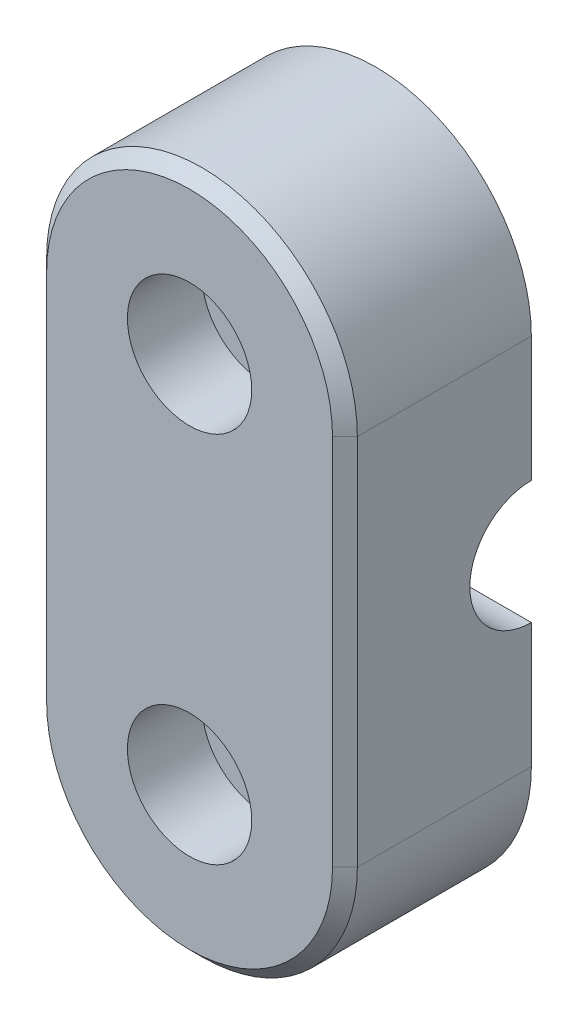
ISO-10303-21;
HEADER;
FILE_DESCRIPTION(('STEP AP214'),'2;1');
FILE_NAME('part.step','',(''),(''),'','','');
FILE_SCHEMA(('AUTOMOTIVE_DESIGN { 1 0 10303 214 1 1 1 1 }'));
ENDSEC;
DATA;
#1=APPLICATION_CONTEXT('core data for automotive mechanical design processes');
#2=APPLICATION_PROTOCOL_DEFINITION('international standard','automotive_design',2000,#1);
#3=PRODUCT_CONTEXT('',#1,'mechanical');
#4=PRODUCT('Part','Part','',(#3));
#5=PRODUCT_RELATED_PRODUCT_CATEGORY('part','',(#4));
#6=PRODUCT_DEFINITION_FORMATION('','',#4);
#7=PRODUCT_DEFINITION_CONTEXT('part definition',#1,'design');
#8=PRODUCT_DEFINITION('design','',#6,#7);
#9=PRODUCT_DEFINITION_SHAPE('','',#8);
#10=(LENGTH_UNIT() NAMED_UNIT(*) SI_UNIT(.MILLI.,.METRE.));
#11=(NAMED_UNIT(*) PLANE_ANGLE_UNIT() SI_UNIT($,.RADIAN.));
#12=(NAMED_UNIT(*) SI_UNIT($,.STERADIAN.) SOLID_ANGLE_UNIT());
#13=UNCERTAINTY_MEASURE_WITH_UNIT(LENGTH_MEASURE(1.E-05),#10,'distance_accuracy_value','');
#14=(GEOMETRIC_REPRESENTATION_CONTEXT(3) GLOBAL_UNCERTAINTY_ASSIGNED_CONTEXT((#13)) GLOBAL_UNIT_ASSIGNED_CONTEXT((#10,
#11,#12)) REPRESENTATION_CONTEXT('',''));
#15=CARTESIAN_POINT('',(0.,0.,0.));
#16=DIRECTION('',(0.,0.,1.));
#17=DIRECTION('',(1.,0.,0.));
#18=AXIS2_PLACEMENT_3D('',#15,#16,#17);
#19=CARTESIAN_POINT('',(-12.501,0.,0.));
#20=DIRECTION('',(1.,0.,0.));
#21=DIRECTION('',(0.,1.,0.));
#22=AXIS2_PLACEMENT_3D('',#19,#20,#21);
#23=CYLINDRICAL_SURFACE('',#22,4.95);
#24=CARTESIAN_POINT('',(-0.95,0.,0.));
#25=DIRECTION('',(1.,0.,0.));
#26=DIRECTION('',(0.,0.,-1.));
#27=AXIS2_PLACEMENT_3D('',#24,#25,#26);
#28=CIRCLE('',#27,4.95);
#29=CARTESIAN_POINT('',(-0.95,4.95,0.));
#30=VERTEX_POINT('',#29);
#31=CARTESIAN_POINT('',(-0.95,-4.95,0.));
#32=VERTEX_POINT('',#31);
#33=EDGE_CURVE('E75',#30,#32,#28,.T.);
#34=ORIENTED_EDGE('',*,*,#33,.T.);
#35=DIRECTION('',(1.,0.,0.));
#36=VECTOR('',#35,1.);
#37=CARTESIAN_POINT('',(-12.501,-4.95,0.));
#38=LINE('',#37,#36);
#39=CARTESIAN_POINT('',(-12.5,-4.95,0.));
#40=VERTEX_POINT('',#39);
#41=EDGE_CURVE('E219',#32,#40,#38,.F.);
#42=ORIENTED_EDGE('',*,*,#41,.T.);
#43=CARTESIAN_POINT('',(-12.5,0.,0.));
#44=DIRECTION('',(1.,0.,0.));
#45=DIRECTION('',(0.,1.,0.));
#46=AXIS2_PLACEMENT_3D('',#43,#44,#45);
#47=CIRCLE('',#46,4.95);
#48=CARTESIAN_POINT('',(-12.5,4.95,0.));
#49=VERTEX_POINT('',#48);
#50=EDGE_CURVE('E226',#40,#49,#47,.F.);
#51=ORIENTED_EDGE('',*,*,#50,.T.);
#52=DIRECTION('',(1.,0.,0.));
#53=VECTOR('',#52,1.);
#54=CARTESIAN_POINT('',(-12.501,4.95,0.));
#55=LINE('',#54,#53);
#56=EDGE_CURVE('E216',#49,#30,#55,.T.);
#57=ORIENTED_EDGE('',*,*,#56,.T.);
#58=EDGE_LOOP('',(#34,#42,#51,#57));
#59=FACE_BOUND('',#58,.T.);
#60=ADVANCED_FACE('F42',(#59),#23,.F.);
#61=CARTESIAN_POINT('',(0.,15.,15.));
#62=DIRECTION('',(0.,0.,-1.));
#63=DIRECTION('',(-1.,0.,0.));
#64=AXIS2_PLACEMENT_3D('',#61,#62,#63);
#65=CYLINDRICAL_SURFACE('',#64,3.25);
#66=CARTESIAN_POINT('',(0.,15.,0.));
#67=DIRECTION('',(0.,0.,1.));
#68=DIRECTION('',(1.,0.,0.));
#69=AXIS2_PLACEMENT_3D('',#66,#67,#68);
#70=CIRCLE('',#69,3.25);
#71=CARTESIAN_POINT('',(3.25,15.,0.));
#72=VERTEX_POINT('',#71);
#73=EDGE_CURVE('E233',#72,#72,#70,.T.);
#74=ORIENTED_EDGE('',*,*,#73,.F.);
#75=EDGE_LOOP('',(#74));
#76=FACE_BOUND('',#75,.T.);
#77=CARTESIAN_POINT('',(0.,15.,9.));
#78=DIRECTION('',(0.,0.,1.));
#79=DIRECTION('',(1.,0.,0.));
#80=AXIS2_PLACEMENT_3D('',#77,#78,#79);
#81=CIRCLE('',#80,3.25);
#82=CARTESIAN_POINT('',(3.25,15.,9.));
#83=VERTEX_POINT('',#82);
#84=EDGE_CURVE('E47',#83,#83,#81,.T.);
#85=ORIENTED_EDGE('',*,*,#84,.T.);
#86=EDGE_LOOP('',(#85));
#87=FACE_BOUND('',#86,.T.);
#88=ADVANCED_FACE('F309',(#76,#87),#65,.F.);
#89=CARTESIAN_POINT('',(0.,-15.,15.));
#90=DIRECTION('',(0.,0.,-1.));
#91=DIRECTION('',(-1.,0.,0.));
#92=AXIS2_PLACEMENT_3D('',#89,#90,#91);
#93=CYLINDRICAL_SURFACE('',#92,3.25);
#94=CARTESIAN_POINT('',(0.,-15.,0.));
#95=DIRECTION('',(0.,0.,1.));
#96=DIRECTION('',(1.,0.,0.));
#97=AXIS2_PLACEMENT_3D('',#94,#95,#96);
#98=CIRCLE('',#97,3.25);
#99=CARTESIAN_POINT('',(3.25,-15.,0.));
#100=VERTEX_POINT('',#99);
#101=EDGE_CURVE('E229',#100,#100,#98,.T.);
#102=ORIENTED_EDGE('',*,*,#101,.F.);
#103=EDGE_LOOP('',(#102));
#104=FACE_BOUND('',#103,.T.);
#105=CARTESIAN_POINT('',(0.,-15.,9.));
#106=DIRECTION('',(0.,0.,1.));
#107=DIRECTION('',(1.,0.,0.));
#108=AXIS2_PLACEMENT_3D('',#105,#106,#107);
#109=CIRCLE('',#108,3.25);
#110=CARTESIAN_POINT('',(3.25,-15.,9.));
#111=VERTEX_POINT('',#110);
#112=EDGE_CURVE('E204',#111,#111,#109,.T.);
#113=ORIENTED_EDGE('',*,*,#112,.T.);
#114=EDGE_LOOP('',(#113));
#115=FACE_BOUND('',#114,.T.);
#116=ADVANCED_FACE('F390',(#104,#115),#93,.F.);
#117=CARTESIAN_POINT('',(0.,0.,0.));
#118=DIRECTION('',(0.,0.,1.));
#119=DIRECTION('',(1.,0.,0.));
#120=AXIS2_PLACEMENT_3D('',#117,#118,#119);
#121=PLANE('',#120);
#122=ORIENTED_EDGE('',*,*,#101,.T.);
#123=EDGE_LOOP('',(#122));
#124=FACE_BOUND('',#123,.T.);
#125=DIRECTION('',(0.,-1.,0.));
#126=VECTOR('',#125,1.);
#127=CARTESIAN_POINT('',(-12.5,0.,0.));
#128=LINE('',#127,#126);
#129=CARTESIAN_POINT('',(-12.5,-15.,0.));
#130=VERTEX_POINT('',#129);
#131=EDGE_CURVE('E237',#40,#130,#128,.T.);
#132=ORIENTED_EDGE('',*,*,#131,.F.);
#133=ORIENTED_EDGE('',*,*,#41,.F.);
#134=DIRECTION('',(0.,-1.,0.));
#135=VECTOR('',#134,1.);
#136=CARTESIAN_POINT('',(-0.95,0.,0.));
#137=LINE('',#136,#135);
#138=CARTESIAN_POINT('',(-0.95,-4.5,0.));
#139=VERTEX_POINT('',#138);
#140=EDGE_CURVE('E180',#139,#32,#137,.T.);
#141=ORIENTED_EDGE('',*,*,#140,.F.);
#142=DIRECTION('',(-1.,0.,0.));
#143=VECTOR('',#142,1.);
#144=CARTESIAN_POINT('',(0.95,-4.5,0.));
#145=LINE('',#144,#143);
#146=CARTESIAN_POINT('',(0.95,-4.5,0.));
#147=VERTEX_POINT('',#146);
#148=EDGE_CURVE('E171',#147,#139,#145,.T.);
#149=ORIENTED_EDGE('',*,*,#148,.F.);
#150=DIRECTION('',(0.,-1.,0.));
#151=VECTOR('',#150,1.);
#152=CARTESIAN_POINT('',(0.95,0.,0.));
#153=LINE('',#152,#151);
#154=CARTESIAN_POINT('',(0.95,-4.95,0.));
#155=VERTEX_POINT('',#154);
#156=EDGE_CURVE('E178',#147,#155,#153,.T.);
#157=ORIENTED_EDGE('',*,*,#156,.T.);
#158=CARTESIAN_POINT('',(12.5,-4.95,0.));
#159=VERTEX_POINT('',#158);
#160=EDGE_CURVE('E220',#159,#155,#38,.F.);
#161=ORIENTED_EDGE('',*,*,#160,.F.);
#162=DIRECTION('',(0.,-1.,0.));
#163=VECTOR('',#162,1.);
#164=CARTESIAN_POINT('',(12.5,0.,0.));
#165=LINE('',#164,#163);
#166=CARTESIAN_POINT('',(12.5,-15.,0.));
#167=VERTEX_POINT('',#166);
#168=EDGE_CURVE('E246',#159,#167,#165,.T.);
#169=ORIENTED_EDGE('',*,*,#168,.T.);
#170=CARTESIAN_POINT('',(0.,-15.,0.));
#171=DIRECTION('',(0.,0.,1.));
#172=DIRECTION('',(1.,0.,0.));
#173=AXIS2_PLACEMENT_3D('',#170,#171,#172);
#174=CIRCLE('',#173,12.5);
#175=EDGE_CURVE('E242',#130,#167,#174,.T.);
#176=ORIENTED_EDGE('',*,*,#175,.F.);
#177=EDGE_LOOP('',(#132,#133,#141,#149,#157,#161,#169,#176));
#178=FACE_BOUND('',#177,.T.);
#179=ADVANCED_FACE('F363',(#124,#178),#121,.F.);
#180=CARTESIAN_POINT('',(-12.5,0.,15.));
#181=DIRECTION('',(1.,0.,0.));
#182=DIRECTION('',(0.,1.,0.));
#183=AXIS2_PLACEMENT_3D('',#180,#181,#182);
#184=PLANE('',#183);
#185=DIRECTION('',(0.,0.,-1.));
#186=VECTOR('',#185,1.);
#187=CARTESIAN_POINT('',(-12.5,-15.,15.));
#188=LINE('',#187,#186);
#189=CARTESIAN_POINT('',(-12.5,-15.,14.));
#190=VERTEX_POINT('',#189);
#191=EDGE_CURVE('E263',#190,#130,#188,.T.);
#192=ORIENTED_EDGE('',*,*,#191,.F.);
#193=DIRECTION('',(0.,1.,0.));
#194=VECTOR('',#193,1.);
#195=CARTESIAN_POINT('',(-12.5,15.,14.));
#196=LINE('',#195,#194);
#197=CARTESIAN_POINT('',(-12.5,15.,14.));
#198=VERTEX_POINT('',#197);
#199=EDGE_CURVE('E279',#190,#198,#196,.T.);
#200=ORIENTED_EDGE('',*,*,#199,.T.);
#201=DIRECTION('',(0.,0.,-1.));
#202=VECTOR('',#201,1.);
#203=CARTESIAN_POINT('',(-12.5,15.,15.));
#204=LINE('',#203,#202);
#205=CARTESIAN_POINT('',(-12.5,15.,0.));
#206=VERTEX_POINT('',#205);
#207=EDGE_CURVE('E254',#198,#206,#204,.T.);
#208=ORIENTED_EDGE('',*,*,#207,.T.);
#209=EDGE_CURVE('E238',#206,#49,#128,.T.);
#210=ORIENTED_EDGE('',*,*,#209,.T.);
#211=ORIENTED_EDGE('',*,*,#50,.F.);
#212=ORIENTED_EDGE('',*,*,#131,.T.);
#213=EDGE_LOOP('',(#192,#200,#208,#210,#211,#212));
#214=FACE_BOUND('',#213,.T.);
#215=ADVANCED_FACE('F372',(#214),#184,.F.);
#216=CARTESIAN_POINT('',(0.,-15.,15.));
#217=DIRECTION('',(0.,0.,-1.));
#218=DIRECTION('',(-1.,0.,0.));
#219=AXIS2_PLACEMENT_3D('',#216,#217,#218);
#220=CYLINDRICAL_SURFACE('',#219,12.5);
#221=DIRECTION('',(0.,0.,-1.));
#222=VECTOR('',#221,1.);
#223=CARTESIAN_POINT('',(12.5,-15.,15.));
#224=LINE('',#223,#222);
#225=CARTESIAN_POINT('',(12.5,-15.,14.));
#226=VERTEX_POINT('',#225);
#227=EDGE_CURVE('E260',#226,#167,#224,.T.);
#228=ORIENTED_EDGE('',*,*,#227,.F.);
#229=CARTESIAN_POINT('',(0.,-15.,14.));
#230=DIRECTION('',(0.,0.,1.));
#231=DIRECTION('',(1.,0.,0.));
#232=AXIS2_PLACEMENT_3D('',#229,#230,#231);
#233=CIRCLE('',#232,12.5);
#234=EDGE_CURVE('E53',#226,#190,#233,.F.);
#235=ORIENTED_EDGE('',*,*,#234,.T.);
#236=ORIENTED_EDGE('',*,*,#191,.T.);
#237=ORIENTED_EDGE('',*,*,#175,.T.);
#238=EDGE_LOOP('',(#228,#235,#236,#237));
#239=FACE_BOUND('',#238,.T.);
#240=ADVANCED_FACE('F358',(#239),#220,.T.);
#241=CARTESIAN_POINT('',(12.5,0.,15.));
#242=DIRECTION('',(1.,0.,0.));
#243=DIRECTION('',(0.,1.,0.));
#244=AXIS2_PLACEMENT_3D('',#241,#242,#243);
#245=PLANE('',#244);
#246=DIRECTION('',(0.,0.,-1.));
#247=VECTOR('',#246,1.);
#248=CARTESIAN_POINT('',(12.5,15.,15.));
#249=LINE('',#248,#247);
#250=CARTESIAN_POINT('',(12.5,15.,14.));
#251=VERTEX_POINT('',#250);
#252=CARTESIAN_POINT('',(12.5,15.,0.));
#253=VERTEX_POINT('',#252);
#254=EDGE_CURVE('E257',#251,#253,#249,.T.);
#255=ORIENTED_EDGE('',*,*,#254,.F.);
#256=DIRECTION('',(0.,-1.,0.));
#257=VECTOR('',#256,1.);
#258=CARTESIAN_POINT('',(12.5,0.,14.));
#259=LINE('',#258,#257);
#260=EDGE_CURVE('E11',#251,#226,#259,.T.);
#261=ORIENTED_EDGE('',*,*,#260,.T.);
#262=ORIENTED_EDGE('',*,*,#227,.T.);
#263=ORIENTED_EDGE('',*,*,#168,.F.);
#264=CARTESIAN_POINT('',(12.5,0.,0.));
#265=DIRECTION('',(1.,0.,0.));
#266=DIRECTION('',(0.,1.,0.));
#267=AXIS2_PLACEMENT_3D('',#264,#265,#266);
#268=CIRCLE('',#267,4.95);
#269=CARTESIAN_POINT('',(12.5,4.95,0.));
#270=VERTEX_POINT('',#269);
#271=EDGE_CURVE('E223',#270,#159,#268,.T.);
#272=ORIENTED_EDGE('',*,*,#271,.F.);
#273=EDGE_CURVE('E247',#253,#270,#165,.T.);
#274=ORIENTED_EDGE('',*,*,#273,.F.);
#275=EDGE_LOOP('',(#255,#261,#262,#263,#272,#274));
#276=FACE_BOUND('',#275,.T.);
#277=ADVANCED_FACE('F353',(#276),#245,.T.);
#278=CARTESIAN_POINT('',(0.,15.,15.));
#279=DIRECTION('',(0.,0.,-1.));
#280=DIRECTION('',(-1.,0.,0.));
#281=AXIS2_PLACEMENT_3D('',#278,#279,#280);
#282=CYLINDRICAL_SURFACE('',#281,12.5);
#283=ORIENTED_EDGE('',*,*,#207,.F.);
#284=CARTESIAN_POINT('',(0.,15.,14.));
#285=DIRECTION('',(0.,0.,1.));
#286=DIRECTION('',(1.,0.,0.));
#287=AXIS2_PLACEMENT_3D('',#284,#285,#286);
#288=CIRCLE('',#287,12.5);
#289=EDGE_CURVE('E283',#198,#251,#288,.F.);
#290=ORIENTED_EDGE('',*,*,#289,.T.);
#291=ORIENTED_EDGE('',*,*,#254,.T.);
#292=CARTESIAN_POINT('',(0.,15.,0.));
#293=DIRECTION('',(0.,0.,1.));
#294=DIRECTION('',(1.,0.,0.));
#295=AXIS2_PLACEMENT_3D('',#292,#293,#294);
#296=CIRCLE('',#295,12.5);
#297=EDGE_CURVE('E250',#253,#206,#296,.T.);
#298=ORIENTED_EDGE('',*,*,#297,.T.);
#299=EDGE_LOOP('',(#283,#290,#291,#298));
#300=FACE_BOUND('',#299,.T.);
#301=ADVANCED_FACE('F327',(#300),#282,.T.);
#302=CARTESIAN_POINT('',(0.,0.,15.));
#303=DIRECTION('',(0.,0.,1.));
#304=DIRECTION('',(1.,0.,0.));
#305=AXIS2_PLACEMENT_3D('',#302,#303,#304);
#306=PLANE('',#305);
#307=CARTESIAN_POINT('',(0.,15.,15.));
#308=DIRECTION('',(0.,0.,1.));
#309=DIRECTION('',(1.,0.,0.));
#310=AXIS2_PLACEMENT_3D('',#307,#308,#309);
#311=CIRCLE('',#310,5.);
#312=CARTESIAN_POINT('',(5.,15.,15.));
#313=VERTEX_POINT('',#312);
#314=EDGE_CURVE('E205',#313,#313,#311,.T.);
#315=ORIENTED_EDGE('',*,*,#314,.F.);
#316=EDGE_LOOP('',(#315));
#317=FACE_BOUND('',#316,.T.);
#318=CARTESIAN_POINT('',(0.,-15.,15.));
#319=DIRECTION('',(0.,0.,1.));
#320=DIRECTION('',(1.,0.,0.));
#321=AXIS2_PLACEMENT_3D('',#318,#319,#320);
#322=CIRCLE('',#321,5.);
#323=CARTESIAN_POINT('',(5.,-15.,15.));
#324=VERTEX_POINT('',#323);
#325=EDGE_CURVE('E170',#324,#324,#322,.T.);
#326=ORIENTED_EDGE('',*,*,#325,.F.);
#327=EDGE_LOOP('',(#326));
#328=FACE_BOUND('',#327,.T.);
#329=CARTESIAN_POINT('',(0.,15.,15.));
#330=DIRECTION('',(0.,0.,1.));
#331=DIRECTION('',(1.,0.,0.));
#332=AXIS2_PLACEMENT_3D('',#329,#330,#331);
#333=CIRCLE('',#332,11.5);
#334=CARTESIAN_POINT('',(11.5,15.,15.));
#335=VERTEX_POINT('',#334);
#336=CARTESIAN_POINT('',(-11.5,15.,15.));
#337=VERTEX_POINT('',#336);
#338=EDGE_CURVE('E272',#335,#337,#333,.T.);
#339=ORIENTED_EDGE('',*,*,#338,.T.);
#340=DIRECTION('',(0.,-1.,0.));
#341=VECTOR('',#340,1.);
#342=CARTESIAN_POINT('',(-11.5,-15.,15.));
#343=LINE('',#342,#341);
#344=CARTESIAN_POINT('',(-11.5,-15.,15.));
#345=VERTEX_POINT('',#344);
#346=EDGE_CURVE('E275',#337,#345,#343,.T.);
#347=ORIENTED_EDGE('',*,*,#346,.T.);
#348=CARTESIAN_POINT('',(0.,-15.,15.));
#349=DIRECTION('',(0.,0.,1.));
#350=DIRECTION('',(1.,0.,0.));
#351=AXIS2_PLACEMENT_3D('',#348,#349,#350);
#352=CIRCLE('',#351,11.5);
#353=CARTESIAN_POINT('',(11.5,-15.,15.));
#354=VERTEX_POINT('',#353);
#355=EDGE_CURVE('E269',#345,#354,#352,.T.);
#356=ORIENTED_EDGE('',*,*,#355,.T.);
#357=DIRECTION('',(0.,1.,0.));
#358=VECTOR('',#357,1.);
#359=CARTESIAN_POINT('',(11.5,0.,15.));
#360=LINE('',#359,#358);
#361=EDGE_CURVE('E266',#354,#335,#360,.T.);
#362=ORIENTED_EDGE('',*,*,#361,.T.);
#363=EDGE_LOOP('',(#339,#347,#356,#362));
#364=FACE_BOUND('',#363,.T.);
#365=ADVANCED_FACE('F324',(#317,#328,#364),#306,.T.);
#366=ORIENTED_EDGE('',*,*,#73,.T.);
#367=EDGE_LOOP('',(#366));
#368=FACE_BOUND('',#367,.T.);
#369=ORIENTED_EDGE('',*,*,#273,.T.);
#370=CARTESIAN_POINT('',(0.95,4.95,0.));
#371=VERTEX_POINT('',#370);
#372=EDGE_CURVE('E184',#371,#270,#55,.T.);
#373=ORIENTED_EDGE('',*,*,#372,.F.);
#374=CARTESIAN_POINT('',(0.95,4.5,0.));
#375=VERTEX_POINT('',#374);
#376=EDGE_CURVE('E176',#371,#375,#153,.T.);
#377=ORIENTED_EDGE('',*,*,#376,.T.);
#378=DIRECTION('',(-1.,0.,0.));
#379=VECTOR('',#378,1.);
#380=CARTESIAN_POINT('',(0.95,4.5,0.));
#381=LINE('',#380,#379);
#382=CARTESIAN_POINT('',(-0.95,4.5,0.));
#383=VERTEX_POINT('',#382);
#384=EDGE_CURVE('E158',#375,#383,#381,.T.);
#385=ORIENTED_EDGE('',*,*,#384,.T.);
#386=EDGE_CURVE('E376',#30,#383,#137,.T.);
#387=ORIENTED_EDGE('',*,*,#386,.F.);
#388=ORIENTED_EDGE('',*,*,#56,.F.);
#389=ORIENTED_EDGE('',*,*,#209,.F.);
#390=ORIENTED_EDGE('',*,*,#297,.F.);
#391=EDGE_LOOP('',(#369,#373,#377,#385,#387,#388,#389,#390));
#392=FACE_BOUND('',#391,.T.);
#393=ADVANCED_FACE('F183',(#368,#392),#121,.F.);
#394=ORIENTED_EDGE('',*,*,#160,.T.);
#395=CARTESIAN_POINT('',(0.95,0.,0.));
#396=DIRECTION('',(1.,0.,0.));
#397=DIRECTION('',(0.,0.,-1.));
#398=AXIS2_PLACEMENT_3D('',#395,#396,#397);
#399=CIRCLE('',#398,4.95);
#400=EDGE_CURVE('E64',#371,#155,#399,.T.);
#401=ORIENTED_EDGE('',*,*,#400,.F.);
#402=ORIENTED_EDGE('',*,*,#372,.T.);
#403=ORIENTED_EDGE('',*,*,#271,.T.);
#404=EDGE_LOOP('',(#394,#401,#402,#403));
#405=FACE_BOUND('',#404,.T.);
#406=ADVANCED_FACE('F386',(#405),#23,.F.);
#407=CARTESIAN_POINT('',(12.5,0.,14.));
#408=DIRECTION('',(-0.707106781186546,0.,-0.707106781186549));
#409=DIRECTION('',(0.,-1.,0.));
#410=AXIS2_PLACEMENT_3D('',#407,#408,#409);
#411=PLANE('',#410);
#412=DIRECTION('',(-0.707106781186549,0.,0.707106781186546));
#413=VECTOR('',#412,1.);
#414=CARTESIAN_POINT('',(12.5,-15.,14.));
#415=LINE('',#414,#413);
#416=EDGE_CURVE('E294',#226,#354,#415,.T.);
#417=ORIENTED_EDGE('',*,*,#416,.F.);
#418=ORIENTED_EDGE('',*,*,#260,.F.);
#419=DIRECTION('',(0.707106781186549,0.,-0.707106781186546));
#420=VECTOR('',#419,1.);
#421=CARTESIAN_POINT('',(11.5,15.,15.));
#422=LINE('',#421,#420);
#423=EDGE_CURVE('E298',#335,#251,#422,.T.);
#424=ORIENTED_EDGE('',*,*,#423,.F.);
#425=ORIENTED_EDGE('',*,*,#361,.F.);
#426=EDGE_LOOP('',(#417,#418,#424,#425));
#427=FACE_BOUND('',#426,.T.);
#428=ADVANCED_FACE('F45',(#427),#411,.F.);
#429=CARTESIAN_POINT('',(0.,15.,15.));
#430=DIRECTION('',(0.,0.,-1.));
#431=DIRECTION('',(-1.,0.,0.));
#432=AXIS2_PLACEMENT_3D('',#429,#430,#431);
#433=CONICAL_SURFACE('',#432,11.5,0.785398163397452);
#434=ORIENTED_EDGE('',*,*,#423,.T.);
#435=ORIENTED_EDGE('',*,*,#289,.F.);
#436=DIRECTION('',(-0.70710678118655,0.,-0.707106781186545));
#437=VECTOR('',#436,1.);
#438=CARTESIAN_POINT('',(-11.5,15.,15.));
#439=LINE('',#438,#437);
#440=EDGE_CURVE('E291',#337,#198,#439,.T.);
#441=ORIENTED_EDGE('',*,*,#440,.F.);
#442=ORIENTED_EDGE('',*,*,#338,.F.);
#443=EDGE_LOOP('',(#434,#435,#441,#442));
#444=FACE_BOUND('',#443,.T.);
#445=ADVANCED_FACE('F338',(#444),#433,.T.);
#446=CARTESIAN_POINT('',(0.,-15.,15.));
#447=DIRECTION('',(0.,0.,-1.));
#448=DIRECTION('',(-1.,0.,0.));
#449=AXIS2_PLACEMENT_3D('',#446,#447,#448);
#450=CONICAL_SURFACE('',#449,11.5,0.785398163397452);
#451=ORIENTED_EDGE('',*,*,#416,.T.);
#452=ORIENTED_EDGE('',*,*,#355,.F.);
#453=DIRECTION('',(0.70710678118655,0.,0.707106781186545));
#454=VECTOR('',#453,1.);
#455=CARTESIAN_POINT('',(-12.5,-15.,14.));
#456=LINE('',#455,#454);
#457=EDGE_CURVE('E288',#190,#345,#456,.T.);
#458=ORIENTED_EDGE('',*,*,#457,.F.);
#459=ORIENTED_EDGE('',*,*,#234,.F.);
#460=EDGE_LOOP('',(#451,#452,#458,#459));
#461=FACE_BOUND('',#460,.T.);
#462=ADVANCED_FACE('F346',(#461),#450,.T.);
#463=CARTESIAN_POINT('',(-11.5,0.,15.));
#464=DIRECTION('',(-0.707106781186546,0.,0.707106781186549));
#465=DIRECTION('',(0.,1.,0.));
#466=AXIS2_PLACEMENT_3D('',#463,#464,#465);
#467=PLANE('',#466);
#468=ORIENTED_EDGE('',*,*,#440,.T.);
#469=ORIENTED_EDGE('',*,*,#199,.F.);
#470=ORIENTED_EDGE('',*,*,#457,.T.);
#471=ORIENTED_EDGE('',*,*,#346,.F.);
#472=EDGE_LOOP('',(#468,#469,#470,#471));
#473=FACE_BOUND('',#472,.T.);
#474=ADVANCED_FACE('F341',(#473),#467,.T.);
#475=CARTESIAN_POINT('',(0.,-15.,9.));
#476=DIRECTION('',(0.,0.,1.));
#477=DIRECTION('',(1.,0.,0.));
#478=AXIS2_PLACEMENT_3D('',#475,#476,#477);
#479=CYLINDRICAL_SURFACE('',#478,5.);
#480=CARTESIAN_POINT('',(0.,-15.,9.));
#481=DIRECTION('',(0.,0.,1.));
#482=DIRECTION('',(1.,0.,0.));
#483=AXIS2_PLACEMENT_3D('',#480,#481,#482);
#484=CIRCLE('',#483,5.);
#485=CARTESIAN_POINT('',(5.,-15.,9.));
#486=VERTEX_POINT('',#485);
#487=EDGE_CURVE('E209',#486,#486,#484,.T.);
#488=ORIENTED_EDGE('',*,*,#487,.F.);
#489=EDGE_LOOP('',(#488));
#490=FACE_BOUND('',#489,.T.);
#491=ORIENTED_EDGE('',*,*,#325,.T.);
#492=EDGE_LOOP('',(#491));
#493=FACE_BOUND('',#492,.T.);
#494=ADVANCED_FACE('F423',(#490,#493),#479,.F.);
#495=CARTESIAN_POINT('',(0.,-15.,9.));
#496=DIRECTION('',(0.,0.,1.));
#497=DIRECTION('',(1.,0.,0.));
#498=AXIS2_PLACEMENT_3D('',#495,#496,#497);
#499=PLANE('',#498);
#500=ORIENTED_EDGE('',*,*,#112,.F.);
#501=EDGE_LOOP('',(#500));
#502=FACE_BOUND('',#501,.T.);
#503=ORIENTED_EDGE('',*,*,#487,.T.);
#504=EDGE_LOOP('',(#503));
#505=FACE_BOUND('',#504,.T.);
#506=ADVANCED_FACE('F320',(#502,#505),#499,.T.);
#507=CARTESIAN_POINT('',(0.,15.,9.));
#508=DIRECTION('',(0.,0.,1.));
#509=DIRECTION('',(1.,0.,0.));
#510=AXIS2_PLACEMENT_3D('',#507,#508,#509);
#511=CYLINDRICAL_SURFACE('',#510,5.);
#512=CARTESIAN_POINT('',(0.,15.,9.));
#513=DIRECTION('',(0.,0.,1.));
#514=DIRECTION('',(1.,0.,0.));
#515=AXIS2_PLACEMENT_3D('',#512,#513,#514);
#516=CIRCLE('',#515,5.);
#517=CARTESIAN_POINT('',(5.,15.,9.));
#518=VERTEX_POINT('',#517);
#519=EDGE_CURVE('E200',#518,#518,#516,.T.);
#520=ORIENTED_EDGE('',*,*,#519,.F.);
#521=EDGE_LOOP('',(#520));
#522=FACE_BOUND('',#521,.T.);
#523=ORIENTED_EDGE('',*,*,#314,.T.);
#524=EDGE_LOOP('',(#523));
#525=FACE_BOUND('',#524,.T.);
#526=ADVANCED_FACE('F314',(#522,#525),#511,.F.);
#527=CARTESIAN_POINT('',(0.,15.,9.));
#528=DIRECTION('',(0.,0.,1.));
#529=DIRECTION('',(1.,0.,0.));
#530=AXIS2_PLACEMENT_3D('',#527,#528,#529);
#531=PLANE('',#530);
#532=ORIENTED_EDGE('',*,*,#84,.F.);
#533=EDGE_LOOP('',(#532));
#534=FACE_BOUND('',#533,.T.);
#535=ORIENTED_EDGE('',*,*,#519,.T.);
#536=EDGE_LOOP('',(#535));
#537=FACE_BOUND('',#536,.T.);
#538=ADVANCED_FACE('F311',(#534,#537),#531,.T.);
#539=CARTESIAN_POINT('',(0.95,0.,0.));
#540=DIRECTION('',(-1.,0.,0.));
#541=DIRECTION('',(0.,0.,1.));
#542=AXIS2_PLACEMENT_3D('',#539,#540,#541);
#543=CYLINDRICAL_SURFACE('',#542,4.5);
#544=CARTESIAN_POINT('',(-0.95,0.,0.));
#545=DIRECTION('',(1.,0.,0.));
#546=DIRECTION('',(0.,0.,-1.));
#547=AXIS2_PLACEMENT_3D('',#544,#545,#546);
#548=CIRCLE('',#547,4.5);
#549=EDGE_CURVE('E164',#383,#139,#548,.T.);
#550=ORIENTED_EDGE('',*,*,#549,.F.);
#551=ORIENTED_EDGE('',*,*,#384,.F.);
#552=CARTESIAN_POINT('',(0.95,0.,0.));
#553=DIRECTION('',(1.,0.,0.));
#554=DIRECTION('',(0.,0.,-1.));
#555=AXIS2_PLACEMENT_3D('',#552,#553,#554);
#556=CIRCLE('',#555,4.5);
#557=EDGE_CURVE('E161',#375,#147,#556,.T.);
#558=ORIENTED_EDGE('',*,*,#557,.T.);
#559=ORIENTED_EDGE('',*,*,#148,.T.);
#560=EDGE_LOOP('',(#550,#551,#558,#559));
#561=FACE_BOUND('',#560,.T.);
#562=ADVANCED_FACE('F160',(#561),#543,.F.);
#563=CARTESIAN_POINT('',(0.95,0.,0.));
#564=DIRECTION('',(1.,0.,0.));
#565=DIRECTION('',(0.,0.,-1.));
#566=AXIS2_PLACEMENT_3D('',#563,#564,#565);
#567=PLANE('',#566);
#568=ORIENTED_EDGE('',*,*,#557,.F.);
#569=ORIENTED_EDGE('',*,*,#376,.F.);
#570=ORIENTED_EDGE('',*,*,#400,.T.);
#571=ORIENTED_EDGE('',*,*,#156,.F.);
#572=EDGE_LOOP('',(#568,#569,#570,#571));
#573=FACE_BOUND('',#572,.T.);
#574=ADVANCED_FACE('F175',(#573),#567,.T.);
#575=CARTESIAN_POINT('',(-0.95,0.,0.));
#576=DIRECTION('',(1.,0.,0.));
#577=DIRECTION('',(0.,0.,-1.));
#578=AXIS2_PLACEMENT_3D('',#575,#576,#577);
#579=PLANE('',#578);
#580=ORIENTED_EDGE('',*,*,#549,.T.);
#581=ORIENTED_EDGE('',*,*,#140,.T.);
#582=ORIENTED_EDGE('',*,*,#33,.F.);
#583=ORIENTED_EDGE('',*,*,#386,.T.);
#584=EDGE_LOOP('',(#580,#581,#582,#583));
#585=FACE_BOUND('',#584,.T.);
#586=ADVANCED_FACE('F383',(#585),#579,.F.);
#587=CLOSED_SHELL('',(#60,#88,#116,#179,#215,#240,#277,#301,#365,#393,#406,#428,#445,#462,#474,
#494,#506,#526,#538,#562,#574,#586));
#588=MANIFOLD_SOLID_BREP('B2',#587);
#589=ADVANCED_BREP_SHAPE_REPRESENTATION('',(#18,#588),#14);
#590=SHAPE_DEFINITION_REPRESENTATION(#9,#589);
ENDSEC;
END-ISO-10303-21;
